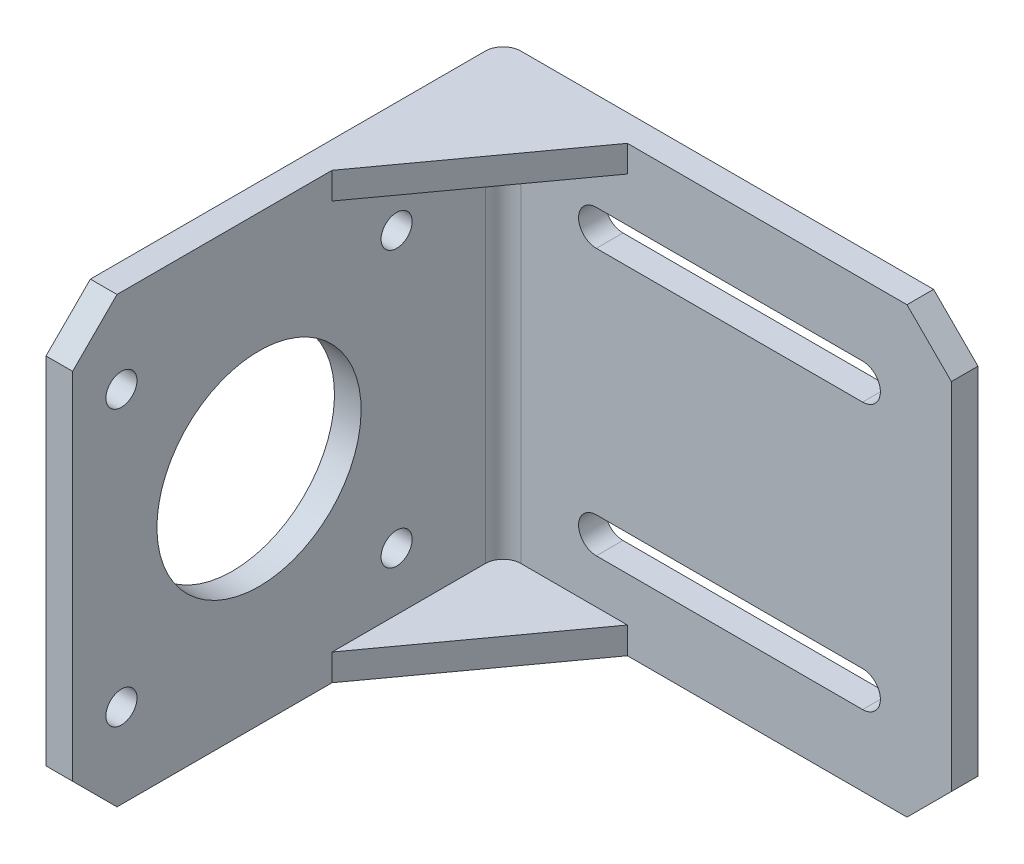
ISO-10303-21;
HEADER;
FILE_DESCRIPTION(('STEP AP214'),'2;1');
FILE_NAME('part.step','',(''),(''),'','','');
FILE_SCHEMA(('AUTOMOTIVE_DESIGN { 1 0 10303 214 1 1 1 1 }'));
ENDSEC;
DATA;
#1=APPLICATION_CONTEXT('core data for automotive mechanical design processes');
#2=APPLICATION_PROTOCOL_DEFINITION('international standard','automotive_design',2000,#1);
#3=PRODUCT_CONTEXT('',#1,'mechanical');
#4=PRODUCT('Part','Part','',(#3));
#5=PRODUCT_RELATED_PRODUCT_CATEGORY('part','',(#4));
#6=PRODUCT_DEFINITION_FORMATION('','',#4);
#7=PRODUCT_DEFINITION_CONTEXT('part definition',#1,'design');
#8=PRODUCT_DEFINITION('design','',#6,#7);
#9=PRODUCT_DEFINITION_SHAPE('','',#8);
#10=(LENGTH_UNIT() NAMED_UNIT(*) SI_UNIT(.MILLI.,.METRE.));
#11=(NAMED_UNIT(*) PLANE_ANGLE_UNIT() SI_UNIT($,.RADIAN.));
#12=(NAMED_UNIT(*) SI_UNIT($,.STERADIAN.) SOLID_ANGLE_UNIT());
#13=UNCERTAINTY_MEASURE_WITH_UNIT(LENGTH_MEASURE(1.E-05),#10,'distance_accuracy_value','');
#14=(GEOMETRIC_REPRESENTATION_CONTEXT(3) GLOBAL_UNCERTAINTY_ASSIGNED_CONTEXT((#13)) GLOBAL_UNIT_ASSIGNED_CONTEXT((#10,
#11,#12)) REPRESENTATION_CONTEXT('',''));
#15=CARTESIAN_POINT('',(0.,0.,0.));
#16=DIRECTION('',(0.,0.,1.));
#17=DIRECTION('',(1.,0.,0.));
#18=AXIS2_PLACEMENT_3D('',#15,#16,#17);
#19=CARTESIAN_POINT('',(-9.75000000000003,0.,3.));
#20=DIRECTION('',(0.809016994374951,0.,0.587785252292469));
#21=DIRECTION('',(0.,1.,0.));
#22=AXIS2_PLACEMENT_3D('',#19,#20,#21);
#23=PLANE('',#22);
#24=DIRECTION('',(0.,-1.,0.));
#25=VECTOR('',#24,1.);
#26=CARTESIAN_POINT('',(-9.75000000000003,-25.,3.));
#27=LINE('',#26,#25);
#28=CARTESIAN_POINT('',(-9.75000000000002,-22.,2.99999999999999));
#29=VERTEX_POINT('',#28);
#30=CARTESIAN_POINT('',(-9.75000000000001,-25.,3.));
#31=VERTEX_POINT('',#30);
#32=EDGE_CURVE('E329',#29,#31,#27,.T.);
#33=ORIENTED_EDGE('',*,*,#32,.F.);
#34=DIRECTION('',(0.587785252292469,0.,-0.809016994374951));
#35=VECTOR('',#34,1.);
#36=CARTESIAN_POINT('',(-9.75000000000003,-22.,3.));
#37=LINE('',#36,#35);
#38=CARTESIAN_POINT('',(-23.75,-22.,22.2693468865966));
#39=VERTEX_POINT('',#38);
#40=EDGE_CURVE('E345',#29,#39,#37,.F.);
#41=ORIENTED_EDGE('',*,*,#40,.T.);
#42=DIRECTION('',(0.,1.,0.));
#43=VECTOR('',#42,1.);
#44=CARTESIAN_POINT('',(-23.75,25.,22.2693468865966));
#45=LINE('',#44,#43);
#46=CARTESIAN_POINT('',(-23.75,-25.,22.2693468865966));
#47=VERTEX_POINT('',#46);
#48=EDGE_CURVE('E334',#47,#39,#45,.T.);
#49=ORIENTED_EDGE('',*,*,#48,.F.);
#50=DIRECTION('',(0.587785252292469,0.,-0.809016994374951));
#51=VECTOR('',#50,1.);
#52=CARTESIAN_POINT('',(-38.6864760679703,-25.,42.8276425021015));
#53=LINE('',#52,#51);
#54=EDGE_CURVE('E337',#31,#47,#53,.F.);
#55=ORIENTED_EDGE('',*,*,#54,.F.);
#56=EDGE_LOOP('',(#33,#41,#49,#55));
#57=FACE_BOUND('',#56,.T.);
#58=ADVANCED_FACE('F32',(#57),#23,.T.);
#59=CARTESIAN_POINT('',(26.75,25.,51.5));
#60=DIRECTION('',(-1.,0.,0.));
#61=DIRECTION('',(0.,-1.,0.));
#62=AXIS2_PLACEMENT_3D('',#59,#60,#61);
#63=PLANE('',#62);
#64=DIRECTION('',(0.,1.,0.));
#65=VECTOR('',#64,1.);
#66=CARTESIAN_POINT('',(26.75,25.,3.));
#67=LINE('',#66,#65);
#68=CARTESIAN_POINT('',(26.75,-20.,3.));
#69=VERTEX_POINT('',#68);
#70=CARTESIAN_POINT('',(26.75,20.,3.));
#71=VERTEX_POINT('',#70);
#72=EDGE_CURVE('E298',#69,#71,#67,.T.);
#73=ORIENTED_EDGE('',*,*,#72,.F.);
#74=DIRECTION('',(0.,0.,-1.));
#75=VECTOR('',#74,1.);
#76=CARTESIAN_POINT('',(26.75,-20.,51.5));
#77=LINE('',#76,#75);
#78=CARTESIAN_POINT('',(26.75,-20.,0.));
#79=VERTEX_POINT('',#78);
#80=EDGE_CURVE('E360',#69,#79,#77,.T.);
#81=ORIENTED_EDGE('',*,*,#80,.T.);
#82=DIRECTION('',(0.,1.,0.));
#83=VECTOR('',#82,1.);
#84=CARTESIAN_POINT('',(26.75,25.,0.));
#85=LINE('',#84,#83);
#86=CARTESIAN_POINT('',(26.75,20.,0.));
#87=VERTEX_POINT('',#86);
#88=EDGE_CURVE('E312',#79,#87,#85,.T.);
#89=ORIENTED_EDGE('',*,*,#88,.T.);
#90=DIRECTION('',(0.,0.,1.));
#91=VECTOR('',#90,1.);
#92=CARTESIAN_POINT('',(26.75,20.,51.5));
#93=LINE('',#92,#91);
#94=EDGE_CURVE('E348',#87,#71,#93,.T.);
#95=ORIENTED_EDGE('',*,*,#94,.T.);
#96=EDGE_LOOP('',(#73,#81,#89,#95));
#97=FACE_BOUND('',#96,.T.);
#98=ADVANCED_FACE('F440',(#97),#63,.F.);
#99=CARTESIAN_POINT('',(-26.75,25.,51.5));
#100=DIRECTION('',(0.,-1.,0.));
#101=DIRECTION('',(0.,0.,-1.));
#102=AXIS2_PLACEMENT_3D('',#99,#100,#101);
#103=PLANE('',#102);
#104=DIRECTION('',(-1.,0.,0.));
#105=VECTOR('',#104,1.);
#106=CARTESIAN_POINT('',(-26.75,25.,0.));
#107=LINE('',#106,#105);
#108=CARTESIAN_POINT('',(21.75,25.,0.));
#109=VERTEX_POINT('',#108);
#110=CARTESIAN_POINT('',(-24.75,25.,0.));
#111=VERTEX_POINT('',#110);
#112=EDGE_CURVE('E322',#109,#111,#107,.T.);
#113=ORIENTED_EDGE('',*,*,#112,.T.);
#114=CARTESIAN_POINT('',(-24.75,25.,2.));
#115=DIRECTION('',(0.,-1.,0.));
#116=DIRECTION('',(0.,0.,-1.));
#117=AXIS2_PLACEMENT_3D('',#114,#115,#116);
#118=CIRCLE('',#117,2.);
#119=CARTESIAN_POINT('',(-26.75,25.,2.));
#120=VERTEX_POINT('',#119);
#121=EDGE_CURVE('E11',#111,#120,#118,.F.);
#122=ORIENTED_EDGE('',*,*,#121,.T.);
#123=DIRECTION('',(0.,0.,-1.));
#124=VECTOR('',#123,1.);
#125=CARTESIAN_POINT('',(-26.75,25.,51.5));
#126=LINE('',#125,#124);
#127=CARTESIAN_POINT('',(-26.75,25.,46.5));
#128=VERTEX_POINT('',#127);
#129=EDGE_CURVE('E326',#128,#120,#126,.T.);
#130=ORIENTED_EDGE('',*,*,#129,.F.);
#131=DIRECTION('',(1.,0.,0.));
#132=VECTOR('',#131,1.);
#133=CARTESIAN_POINT('',(-23.75,25.,46.5));
#134=LINE('',#133,#132);
#135=CARTESIAN_POINT('',(-23.75,25.,46.5));
#136=VERTEX_POINT('',#135);
#137=EDGE_CURVE('E376',#128,#136,#134,.T.);
#138=ORIENTED_EDGE('',*,*,#137,.T.);
#139=DIRECTION('',(0.,0.,1.));
#140=VECTOR('',#139,1.);
#141=CARTESIAN_POINT('',(-23.75,25.,3.));
#142=LINE('',#141,#140);
#143=CARTESIAN_POINT('',(-23.75,25.,22.2693468865966));
#144=VERTEX_POINT('',#143);
#145=EDGE_CURVE('E306',#144,#136,#142,.T.);
#146=ORIENTED_EDGE('',*,*,#145,.F.);
#147=DIRECTION('',(-0.587785252292469,0.,0.809016994374951));
#148=VECTOR('',#147,1.);
#149=CARTESIAN_POINT('',(-38.6864760679703,25.,42.8276425021015));
#150=LINE('',#149,#148);
#151=CARTESIAN_POINT('',(-9.75000000000003,25.,3.));
#152=VERTEX_POINT('',#151);
#153=EDGE_CURVE('E339',#144,#152,#150,.F.);
#154=ORIENTED_EDGE('',*,*,#153,.T.);
#155=DIRECTION('',(-1.,0.,0.));
#156=VECTOR('',#155,1.);
#157=CARTESIAN_POINT('',(26.75,25.,3.));
#158=LINE('',#157,#156);
#159=CARTESIAN_POINT('',(21.75,25.,3.));
#160=VERTEX_POINT('',#159);
#161=EDGE_CURVE('E301',#160,#152,#158,.T.);
#162=ORIENTED_EDGE('',*,*,#161,.F.);
#163=DIRECTION('',(0.,0.,-1.));
#164=VECTOR('',#163,1.);
#165=CARTESIAN_POINT('',(21.75,25.,51.5));
#166=LINE('',#165,#164);
#167=EDGE_CURVE('E378',#160,#109,#166,.T.);
#168=ORIENTED_EDGE('',*,*,#167,.T.);
#169=EDGE_LOOP('',(#113,#122,#130,#138,#146,#154,#162,#168));
#170=FACE_BOUND('',#169,.T.);
#171=ADVANCED_FACE('F431',(#170),#103,.F.);
#172=CARTESIAN_POINT('',(-26.75,25.,51.5));
#173=DIRECTION('',(1.,0.,0.));
#174=DIRECTION('',(0.,1.,0.));
#175=AXIS2_PLACEMENT_3D('',#172,#173,#174);
#176=PLANE('',#175);
#177=CARTESIAN_POINT('',(-26.75,0.,30.5));
#178=DIRECTION('',(-1.,0.,0.));
#179=DIRECTION('',(0.,-1.,0.));
#180=AXIS2_PLACEMENT_3D('',#177,#178,#179);
#181=CIRCLE('',#180,11.5);
#182=CARTESIAN_POINT('',(-26.75,-11.5,30.5));
#183=VERTEX_POINT('',#182);
#184=EDGE_CURVE('E268',#183,#183,#181,.T.);
#185=ORIENTED_EDGE('',*,*,#184,.F.);
#186=EDGE_LOOP('',(#185));
#187=FACE_BOUND('',#186,.T.);
#188=CARTESIAN_POINT('',(-26.75,-15.5,15.));
#189=DIRECTION('',(-1.,0.,0.));
#190=DIRECTION('',(0.,-1.,0.));
#191=AXIS2_PLACEMENT_3D('',#188,#189,#190);
#192=CIRCLE('',#191,1.75);
#193=CARTESIAN_POINT('',(-26.75,-17.25,15.));
#194=VERTEX_POINT('',#193);
#195=EDGE_CURVE('E272',#194,#194,#192,.T.);
#196=ORIENTED_EDGE('',*,*,#195,.F.);
#197=EDGE_LOOP('',(#196));
#198=FACE_BOUND('',#197,.T.);
#199=CARTESIAN_POINT('',(-26.75,15.5,15.));
#200=DIRECTION('',(-1.,0.,0.));
#201=DIRECTION('',(0.,-1.,0.));
#202=AXIS2_PLACEMENT_3D('',#199,#200,#201);
#203=CIRCLE('',#202,1.75);
#204=CARTESIAN_POINT('',(-26.75,13.75,15.));
#205=VERTEX_POINT('',#204);
#206=EDGE_CURVE('E276',#205,#205,#203,.T.);
#207=ORIENTED_EDGE('',*,*,#206,.F.);
#208=EDGE_LOOP('',(#207));
#209=FACE_BOUND('',#208,.T.);
#210=CARTESIAN_POINT('',(-26.75,-15.5,46.));
#211=DIRECTION('',(-1.,0.,0.));
#212=DIRECTION('',(0.,-1.,0.));
#213=AXIS2_PLACEMENT_3D('',#210,#211,#212);
#214=CIRCLE('',#213,1.75);
#215=CARTESIAN_POINT('',(-26.75,-17.25,46.));
#216=VERTEX_POINT('',#215);
#217=EDGE_CURVE('E280',#216,#216,#214,.T.);
#218=ORIENTED_EDGE('',*,*,#217,.F.);
#219=EDGE_LOOP('',(#218));
#220=FACE_BOUND('',#219,.T.);
#221=CARTESIAN_POINT('',(-26.75,15.5,46.));
#222=DIRECTION('',(-1.,0.,0.));
#223=DIRECTION('',(0.,-1.,0.));
#224=AXIS2_PLACEMENT_3D('',#221,#222,#223);
#225=CIRCLE('',#224,1.75);
#226=CARTESIAN_POINT('',(-26.75,13.75,46.));
#227=VERTEX_POINT('',#226);
#228=EDGE_CURVE('E284',#227,#227,#225,.T.);
#229=ORIENTED_EDGE('',*,*,#228,.F.);
#230=EDGE_LOOP('',(#229));
#231=FACE_BOUND('',#230,.T.);
#232=ORIENTED_EDGE('',*,*,#129,.T.);
#233=DIRECTION('',(0.,-1.,0.));
#234=VECTOR('',#233,1.);
#235=CARTESIAN_POINT('',(-26.75,25.,2.));
#236=LINE('',#235,#234);
#237=CARTESIAN_POINT('',(-26.75,-25.,2.));
#238=VERTEX_POINT('',#237);
#239=EDGE_CURVE('E404',#120,#238,#236,.T.);
#240=ORIENTED_EDGE('',*,*,#239,.T.);
#241=DIRECTION('',(0.,0.,-1.));
#242=VECTOR('',#241,1.);
#243=CARTESIAN_POINT('',(-26.75,-25.,51.5));
#244=LINE('',#243,#242);
#245=CARTESIAN_POINT('',(-26.75,-25.,46.5));
#246=VERTEX_POINT('',#245);
#247=EDGE_CURVE('E318',#246,#238,#244,.T.);
#248=ORIENTED_EDGE('',*,*,#247,.F.);
#249=DIRECTION('',(0.,0.707106781186546,0.707106781186549));
#250=VECTOR('',#249,1.);
#251=CARTESIAN_POINT('',(-26.75,-20.,51.5));
#252=LINE('',#251,#250);
#253=CARTESIAN_POINT('',(-26.75,-20.,51.5));
#254=VERTEX_POINT('',#253);
#255=EDGE_CURVE('E387',#246,#254,#252,.T.);
#256=ORIENTED_EDGE('',*,*,#255,.T.);
#257=DIRECTION('',(0.,-1.,0.));
#258=VECTOR('',#257,1.);
#259=CARTESIAN_POINT('',(-26.75,25.,51.5));
#260=LINE('',#259,#258);
#261=CARTESIAN_POINT('',(-26.75,20.,51.5));
#262=VERTEX_POINT('',#261);
#263=EDGE_CURVE('E315',#262,#254,#260,.T.);
#264=ORIENTED_EDGE('',*,*,#263,.F.);
#265=DIRECTION('',(0.,0.707106781186546,-0.707106781186549));
#266=VECTOR('',#265,1.);
#267=CARTESIAN_POINT('',(-26.75,20.,51.5));
#268=LINE('',#267,#266);
#269=EDGE_CURVE('E389',#262,#128,#268,.T.);
#270=ORIENTED_EDGE('',*,*,#269,.T.);
#271=EDGE_LOOP('',(#232,#240,#248,#256,#264,#270));
#272=FACE_BOUND('',#271,.T.);
#273=ADVANCED_FACE('F410',(#187,#198,#209,#220,#231,#272),#176,.F.);
#274=CARTESIAN_POINT('',(-26.75,-25.,51.5));
#275=DIRECTION('',(0.,1.,0.));
#276=DIRECTION('',(0.,0.,1.));
#277=AXIS2_PLACEMENT_3D('',#274,#275,#276);
#278=PLANE('',#277);
#279=ORIENTED_EDGE('',*,*,#247,.T.);
#280=CARTESIAN_POINT('',(-24.75,-25.,2.));
#281=DIRECTION('',(0.,1.,0.));
#282=DIRECTION('',(0.,0.,1.));
#283=AXIS2_PLACEMENT_3D('',#280,#281,#282);
#284=CIRCLE('',#283,2.);
#285=CARTESIAN_POINT('',(-24.75,-25.,0.));
#286=VERTEX_POINT('',#285);
#287=EDGE_CURVE('E54',#238,#286,#284,.F.);
#288=ORIENTED_EDGE('',*,*,#287,.T.);
#289=DIRECTION('',(1.,0.,0.));
#290=VECTOR('',#289,1.);
#291=CARTESIAN_POINT('',(-26.75,-25.,0.));
#292=LINE('',#291,#290);
#293=CARTESIAN_POINT('',(21.7499999999999,-25.,0.));
#294=VERTEX_POINT('',#293);
#295=EDGE_CURVE('E319',#286,#294,#292,.T.);
#296=ORIENTED_EDGE('',*,*,#295,.T.);
#297=DIRECTION('',(0.,0.,1.));
#298=VECTOR('',#297,1.);
#299=CARTESIAN_POINT('',(21.7499999999999,-25.,51.5));
#300=LINE('',#299,#298);
#301=CARTESIAN_POINT('',(21.7499999999999,-25.,3.));
#302=VERTEX_POINT('',#301);
#303=EDGE_CURVE('E370',#294,#302,#300,.T.);
#304=ORIENTED_EDGE('',*,*,#303,.T.);
#305=DIRECTION('',(1.,0.,0.));
#306=VECTOR('',#305,1.);
#307=CARTESIAN_POINT('',(26.75,-25.,3.));
#308=LINE('',#307,#306);
#309=EDGE_CURVE('E303',#31,#302,#308,.T.);
#310=ORIENTED_EDGE('',*,*,#309,.F.);
#311=ORIENTED_EDGE('',*,*,#54,.T.);
#312=DIRECTION('',(0.,0.,1.));
#313=VECTOR('',#312,1.);
#314=CARTESIAN_POINT('',(-23.75,-25.,3.));
#315=LINE('',#314,#313);
#316=CARTESIAN_POINT('',(-23.75,-25.,46.4999999999999));
#317=VERTEX_POINT('',#316);
#318=EDGE_CURVE('E309',#47,#317,#315,.T.);
#319=ORIENTED_EDGE('',*,*,#318,.T.);
#320=DIRECTION('',(-1.,0.,0.));
#321=VECTOR('',#320,1.);
#322=CARTESIAN_POINT('',(-26.75,-25.,46.5));
#323=LINE('',#322,#321);
#324=EDGE_CURVE('E368',#317,#246,#323,.T.);
#325=ORIENTED_EDGE('',*,*,#324,.T.);
#326=EDGE_LOOP('',(#279,#288,#296,#304,#310,#311,#319,#325));
#327=FACE_BOUND('',#326,.T.);
#328=ADVANCED_FACE('F415',(#327),#278,.F.);
#329=CARTESIAN_POINT('',(0.,0.,51.5));
#330=DIRECTION('',(0.,0.,1.));
#331=DIRECTION('',(1.,0.,0.));
#332=AXIS2_PLACEMENT_3D('',#329,#330,#331);
#333=PLANE('',#332);
#334=DIRECTION('',(0.,-1.,0.));
#335=VECTOR('',#334,1.);
#336=CARTESIAN_POINT('',(-23.75,25.,51.5));
#337=LINE('',#336,#335);
#338=CARTESIAN_POINT('',(-23.75,20.,51.5));
#339=VERTEX_POINT('',#338);
#340=CARTESIAN_POINT('',(-23.75,-20.,51.5));
#341=VERTEX_POINT('',#340);
#342=EDGE_CURVE('E296',#339,#341,#337,.T.);
#343=ORIENTED_EDGE('',*,*,#342,.F.);
#344=DIRECTION('',(-1.,0.,0.));
#345=VECTOR('',#344,1.);
#346=CARTESIAN_POINT('',(-26.75,20.,51.5));
#347=LINE('',#346,#345);
#348=EDGE_CURVE('E384',#339,#262,#347,.T.);
#349=ORIENTED_EDGE('',*,*,#348,.T.);
#350=ORIENTED_EDGE('',*,*,#263,.T.);
#351=DIRECTION('',(1.,0.,0.));
#352=VECTOR('',#351,1.);
#353=CARTESIAN_POINT('',(-23.75,-20.,51.5));
#354=LINE('',#353,#352);
#355=EDGE_CURVE('E381',#254,#341,#354,.T.);
#356=ORIENTED_EDGE('',*,*,#355,.T.);
#357=EDGE_LOOP('',(#343,#349,#350,#356));
#358=FACE_BOUND('',#357,.T.);
#359=ADVANCED_FACE('F424',(#358),#333,.T.);
#360=CARTESIAN_POINT('',(0.,0.,0.));
#361=DIRECTION('',(0.,0.,1.));
#362=DIRECTION('',(1.,0.,0.));
#363=AXIS2_PLACEMENT_3D('',#360,#361,#362);
#364=PLANE('',#363);
#365=DIRECTION('',(-1.,0.,0.));
#366=VECTOR('',#365,1.);
#367=CARTESIAN_POINT('',(0.,-13.,0.));
#368=LINE('',#367,#366);
#369=CARTESIAN_POINT('',(16.75,-13.,0.));
#370=VERTEX_POINT('',#369);
#371=CARTESIAN_POINT('',(-13.25,-13.,0.));
#372=VERTEX_POINT('',#371);
#373=EDGE_CURVE('E230',#370,#372,#368,.T.);
#374=ORIENTED_EDGE('',*,*,#373,.T.);
#375=CARTESIAN_POINT('',(-13.25,-15.,0.));
#376=DIRECTION('',(0.,0.,1.));
#377=DIRECTION('',(1.,0.,0.));
#378=AXIS2_PLACEMENT_3D('',#375,#376,#377);
#379=CIRCLE('',#378,2.);
#380=CARTESIAN_POINT('',(-13.25,-17.,0.));
#381=VERTEX_POINT('',#380);
#382=EDGE_CURVE('E233',#372,#381,#379,.T.);
#383=ORIENTED_EDGE('',*,*,#382,.T.);
#384=DIRECTION('',(1.,0.,0.));
#385=VECTOR('',#384,1.);
#386=CARTESIAN_POINT('',(0.,-17.,0.));
#387=LINE('',#386,#385);
#388=CARTESIAN_POINT('',(16.75,-17.,0.));
#389=VERTEX_POINT('',#388);
#390=EDGE_CURVE('E225',#381,#389,#387,.T.);
#391=ORIENTED_EDGE('',*,*,#390,.T.);
#392=CARTESIAN_POINT('',(16.75,-15.,0.));
#393=DIRECTION('',(0.,0.,1.));
#394=DIRECTION('',(1.,0.,0.));
#395=AXIS2_PLACEMENT_3D('',#392,#393,#394);
#396=CIRCLE('',#395,2.);
#397=EDGE_CURVE('E200',#389,#370,#396,.T.);
#398=ORIENTED_EDGE('',*,*,#397,.T.);
#399=EDGE_LOOP('',(#374,#383,#391,#398));
#400=FACE_BOUND('',#399,.T.);
#401=DIRECTION('',(-1.,0.,0.));
#402=VECTOR('',#401,1.);
#403=CARTESIAN_POINT('',(0.,17.,0.));
#404=LINE('',#403,#402);
#405=CARTESIAN_POINT('',(16.75,17.,0.));
#406=VERTEX_POINT('',#405);
#407=CARTESIAN_POINT('',(-13.25,17.,0.));
#408=VERTEX_POINT('',#407);
#409=EDGE_CURVE('E262',#406,#408,#404,.T.);
#410=ORIENTED_EDGE('',*,*,#409,.T.);
#411=CARTESIAN_POINT('',(-13.25,15.,0.));
#412=DIRECTION('',(0.,0.,1.));
#413=DIRECTION('',(1.,0.,0.));
#414=AXIS2_PLACEMENT_3D('',#411,#412,#413);
#415=CIRCLE('',#414,2.);
#416=CARTESIAN_POINT('',(-13.25,13.,0.));
#417=VERTEX_POINT('',#416);
#418=EDGE_CURVE('E265',#408,#417,#415,.T.);
#419=ORIENTED_EDGE('',*,*,#418,.T.);
#420=DIRECTION('',(1.,0.,0.));
#421=VECTOR('',#420,1.);
#422=CARTESIAN_POINT('',(0.,13.,0.));
#423=LINE('',#422,#421);
#424=CARTESIAN_POINT('',(16.75,13.,0.));
#425=VERTEX_POINT('',#424);
#426=EDGE_CURVE('E250',#417,#425,#423,.T.);
#427=ORIENTED_EDGE('',*,*,#426,.T.);
#428=CARTESIAN_POINT('',(16.75,15.,0.));
#429=DIRECTION('',(0.,0.,1.));
#430=DIRECTION('',(1.,0.,0.));
#431=AXIS2_PLACEMENT_3D('',#428,#429,#430);
#432=CIRCLE('',#431,2.);
#433=EDGE_CURVE('E259',#425,#406,#432,.T.);
#434=ORIENTED_EDGE('',*,*,#433,.T.);
#435=EDGE_LOOP('',(#410,#419,#427,#434));
#436=FACE_BOUND('',#435,.T.);
#437=ORIENTED_EDGE('',*,*,#295,.F.);
#438=DIRECTION('',(0.,-1.,0.));
#439=VECTOR('',#438,1.);
#440=CARTESIAN_POINT('',(-24.75,0.,0.));
#441=LINE('',#440,#439);
#442=EDGE_CURVE('E40',#286,#111,#441,.F.);
#443=ORIENTED_EDGE('',*,*,#442,.T.);
#444=ORIENTED_EDGE('',*,*,#112,.F.);
#445=DIRECTION('',(-0.707106781186546,0.707106781186549,0.));
#446=VECTOR('',#445,1.);
#447=CARTESIAN_POINT('',(21.75,25.,0.));
#448=LINE('',#447,#446);
#449=EDGE_CURVE('E363',#109,#87,#448,.F.);
#450=ORIENTED_EDGE('',*,*,#449,.T.);
#451=ORIENTED_EDGE('',*,*,#88,.F.);
#452=DIRECTION('',(0.707106781186549,0.707106781186546,0.));
#453=VECTOR('',#452,1.);
#454=CARTESIAN_POINT('',(26.75,-20.,0.));
#455=LINE('',#454,#453);
#456=EDGE_CURVE('E365',#79,#294,#455,.F.);
#457=ORIENTED_EDGE('',*,*,#456,.T.);
#458=EDGE_LOOP('',(#437,#443,#444,#450,#451,#457));
#459=FACE_BOUND('',#458,.T.);
#460=ADVANCED_FACE('F479',(#400,#436,#459),#364,.F.);
#461=CARTESIAN_POINT('',(-23.75,25.,3.));
#462=DIRECTION('',(-1.,0.,0.));
#463=DIRECTION('',(0.,-1.,0.));
#464=AXIS2_PLACEMENT_3D('',#461,#462,#463);
#465=PLANE('',#464);
#466=CARTESIAN_POINT('',(-23.75,0.,30.5));
#467=DIRECTION('',(-1.,0.,0.));
#468=DIRECTION('',(0.,-1.,0.));
#469=AXIS2_PLACEMENT_3D('',#466,#467,#468);
#470=CIRCLE('',#469,11.5);
#471=CARTESIAN_POINT('',(-23.75,-11.5,30.5));
#472=VERTEX_POINT('',#471);
#473=EDGE_CURVE('E271',#472,#472,#470,.T.);
#474=ORIENTED_EDGE('',*,*,#473,.T.);
#475=EDGE_LOOP('',(#474));
#476=FACE_BOUND('',#475,.T.);
#477=CARTESIAN_POINT('',(-23.75,-15.5,15.));
#478=DIRECTION('',(-1.,0.,0.));
#479=DIRECTION('',(0.,-1.,0.));
#480=AXIS2_PLACEMENT_3D('',#477,#478,#479);
#481=CIRCLE('',#480,1.75);
#482=CARTESIAN_POINT('',(-23.75,-17.25,15.));
#483=VERTEX_POINT('',#482);
#484=EDGE_CURVE('E275',#483,#483,#481,.T.);
#485=ORIENTED_EDGE('',*,*,#484,.T.);
#486=EDGE_LOOP('',(#485));
#487=FACE_BOUND('',#486,.T.);
#488=CARTESIAN_POINT('',(-23.75,15.5,15.));
#489=DIRECTION('',(-1.,0.,0.));
#490=DIRECTION('',(0.,-1.,0.));
#491=AXIS2_PLACEMENT_3D('',#488,#489,#490);
#492=CIRCLE('',#491,1.75);
#493=CARTESIAN_POINT('',(-23.75,13.75,15.));
#494=VERTEX_POINT('',#493);
#495=EDGE_CURVE('E279',#494,#494,#492,.T.);
#496=ORIENTED_EDGE('',*,*,#495,.T.);
#497=EDGE_LOOP('',(#496));
#498=FACE_BOUND('',#497,.T.);
#499=CARTESIAN_POINT('',(-23.75,-15.5,46.));
#500=DIRECTION('',(-1.,0.,0.));
#501=DIRECTION('',(0.,-1.,0.));
#502=AXIS2_PLACEMENT_3D('',#499,#500,#501);
#503=CIRCLE('',#502,1.75);
#504=CARTESIAN_POINT('',(-23.75,-17.25,46.));
#505=VERTEX_POINT('',#504);
#506=EDGE_CURVE('E283',#505,#505,#503,.T.);
#507=ORIENTED_EDGE('',*,*,#506,.T.);
#508=EDGE_LOOP('',(#507));
#509=FACE_BOUND('',#508,.T.);
#510=CARTESIAN_POINT('',(-23.75,15.5,46.));
#511=DIRECTION('',(-1.,0.,0.));
#512=DIRECTION('',(0.,-1.,0.));
#513=AXIS2_PLACEMENT_3D('',#510,#511,#512);
#514=CIRCLE('',#513,1.75);
#515=CARTESIAN_POINT('',(-23.75,13.75,46.));
#516=VERTEX_POINT('',#515);
#517=EDGE_CURVE('E287',#516,#516,#514,.T.);
#518=ORIENTED_EDGE('',*,*,#517,.T.);
#519=EDGE_LOOP('',(#518));
#520=FACE_BOUND('',#519,.T.);
#521=DIRECTION('',(0.,0.,-1.));
#522=VECTOR('',#521,1.);
#523=CARTESIAN_POINT('',(-23.75,-22.,2.99999999999999));
#524=LINE('',#523,#522);
#525=CARTESIAN_POINT('',(-23.75,-22.,5.));
#526=VERTEX_POINT('',#525);
#527=EDGE_CURVE('E290',#39,#526,#524,.T.);
#528=ORIENTED_EDGE('',*,*,#527,.T.);
#529=DIRECTION('',(0.,1.,0.));
#530=VECTOR('',#529,1.);
#531=CARTESIAN_POINT('',(-23.75,22.,5.));
#532=LINE('',#531,#530);
#533=CARTESIAN_POINT('',(-23.75,22.,4.99999999999999));
#534=VERTEX_POINT('',#533);
#535=EDGE_CURVE('E395',#526,#534,#532,.T.);
#536=ORIENTED_EDGE('',*,*,#535,.T.);
#537=DIRECTION('',(0.,0.,1.));
#538=VECTOR('',#537,1.);
#539=CARTESIAN_POINT('',(-23.75,22.,3.));
#540=LINE('',#539,#538);
#541=CARTESIAN_POINT('',(-23.75,22.,22.2693468865966));
#542=VERTEX_POINT('',#541);
#543=EDGE_CURVE('E288',#534,#542,#540,.T.);
#544=ORIENTED_EDGE('',*,*,#543,.T.);
#545=EDGE_CURVE('E333',#542,#144,#45,.T.);
#546=ORIENTED_EDGE('',*,*,#545,.T.);
#547=ORIENTED_EDGE('',*,*,#145,.T.);
#548=DIRECTION('',(0.,-0.707106781186546,0.707106781186549));
#549=VECTOR('',#548,1.);
#550=CARTESIAN_POINT('',(-23.75,20.,51.5));
#551=LINE('',#550,#549);
#552=EDGE_CURVE('E393',#136,#339,#551,.T.);
#553=ORIENTED_EDGE('',*,*,#552,.T.);
#554=ORIENTED_EDGE('',*,*,#342,.T.);
#555=DIRECTION('',(0.,-0.707106781186546,-0.707106781186549));
#556=VECTOR('',#555,1.);
#557=CARTESIAN_POINT('',(-23.75,-20.,51.5));
#558=LINE('',#557,#556);
#559=EDGE_CURVE('E391',#341,#317,#558,.T.);
#560=ORIENTED_EDGE('',*,*,#559,.T.);
#561=ORIENTED_EDGE('',*,*,#318,.F.);
#562=ORIENTED_EDGE('',*,*,#48,.T.);
#563=EDGE_LOOP('',(#528,#536,#544,#546,#547,#553,#554,#560,#561,#562));
#564=FACE_BOUND('',#563,.T.);
#565=ADVANCED_FACE('F461',(#476,#487,#498,#509,#520,#564),#465,.F.);
#566=CARTESIAN_POINT('',(0.,0.,3.));
#567=DIRECTION('',(0.,0.,-1.));
#568=DIRECTION('',(-1.,0.,0.));
#569=AXIS2_PLACEMENT_3D('',#566,#567,#568);
#570=PLANE('',#569);
#571=DIRECTION('',(1.,0.,0.));
#572=VECTOR('',#571,1.);
#573=CARTESIAN_POINT('',(-13.25,-17.,3.));
#574=LINE('',#573,#572);
#575=CARTESIAN_POINT('',(-13.25,-17.,3.));
#576=VERTEX_POINT('',#575);
#577=CARTESIAN_POINT('',(16.75,-17.,3.));
#578=VERTEX_POINT('',#577);
#579=EDGE_CURVE('E208',#576,#578,#574,.T.);
#580=ORIENTED_EDGE('',*,*,#579,.F.);
#581=CARTESIAN_POINT('',(-13.25,-15.,3.));
#582=DIRECTION('',(0.,0.,1.));
#583=DIRECTION('',(1.,0.,0.));
#584=AXIS2_PLACEMENT_3D('',#581,#582,#583);
#585=CIRCLE('',#584,2.);
#586=CARTESIAN_POINT('',(-13.25,-13.,3.));
#587=VERTEX_POINT('',#586);
#588=EDGE_CURVE('E213',#587,#576,#585,.T.);
#589=ORIENTED_EDGE('',*,*,#588,.F.);
#590=DIRECTION('',(-1.,0.,0.));
#591=VECTOR('',#590,1.);
#592=CARTESIAN_POINT('',(-13.25,-13.,3.));
#593=LINE('',#592,#591);
#594=CARTESIAN_POINT('',(16.75,-13.,3.));
#595=VERTEX_POINT('',#594);
#596=EDGE_CURVE('E218',#595,#587,#593,.T.);
#597=ORIENTED_EDGE('',*,*,#596,.F.);
#598=CARTESIAN_POINT('',(16.75,-15.,3.));
#599=DIRECTION('',(0.,0.,1.));
#600=DIRECTION('',(1.,0.,0.));
#601=AXIS2_PLACEMENT_3D('',#598,#599,#600);
#602=CIRCLE('',#601,2.);
#603=EDGE_CURVE('E197',#578,#595,#602,.T.);
#604=ORIENTED_EDGE('',*,*,#603,.F.);
#605=EDGE_LOOP('',(#580,#589,#597,#604));
#606=FACE_BOUND('',#605,.T.);
#607=DIRECTION('',(1.,0.,0.));
#608=VECTOR('',#607,1.);
#609=CARTESIAN_POINT('',(-13.25,13.,3.));
#610=LINE('',#609,#608);
#611=CARTESIAN_POINT('',(-13.25,13.,3.));
#612=VERTEX_POINT('',#611);
#613=CARTESIAN_POINT('',(16.75,13.,3.));
#614=VERTEX_POINT('',#613);
#615=EDGE_CURVE('E238',#612,#614,#610,.T.);
#616=ORIENTED_EDGE('',*,*,#615,.F.);
#617=CARTESIAN_POINT('',(-13.25,15.,3.));
#618=DIRECTION('',(0.,0.,1.));
#619=DIRECTION('',(1.,0.,0.));
#620=AXIS2_PLACEMENT_3D('',#617,#618,#619);
#621=CIRCLE('',#620,2.);
#622=CARTESIAN_POINT('',(-13.25,17.,3.));
#623=VERTEX_POINT('',#622);
#624=EDGE_CURVE('E236',#623,#612,#621,.T.);
#625=ORIENTED_EDGE('',*,*,#624,.F.);
#626=DIRECTION('',(-1.,0.,0.));
#627=VECTOR('',#626,1.);
#628=CARTESIAN_POINT('',(-13.25,17.,3.));
#629=LINE('',#628,#627);
#630=CARTESIAN_POINT('',(16.75,17.,3.));
#631=VERTEX_POINT('',#630);
#632=EDGE_CURVE('E244',#631,#623,#629,.T.);
#633=ORIENTED_EDGE('',*,*,#632,.F.);
#634=CARTESIAN_POINT('',(16.75,15.,3.));
#635=DIRECTION('',(0.,0.,1.));
#636=DIRECTION('',(1.,0.,0.));
#637=AXIS2_PLACEMENT_3D('',#634,#635,#636);
#638=CIRCLE('',#637,2.);
#639=EDGE_CURVE('E241',#614,#631,#638,.T.);
#640=ORIENTED_EDGE('',*,*,#639,.F.);
#641=EDGE_LOOP('',(#616,#625,#633,#640));
#642=FACE_BOUND('',#641,.T.);
#643=DIRECTION('',(1.,0.,0.));
#644=VECTOR('',#643,1.);
#645=CARTESIAN_POINT('',(-23.75,22.,3.));
#646=LINE('',#645,#644);
#647=CARTESIAN_POINT('',(-21.75,22.,3.));
#648=VERTEX_POINT('',#647);
#649=CARTESIAN_POINT('',(-9.75000000000004,22.,3.));
#650=VERTEX_POINT('',#649);
#651=EDGE_CURVE('E293',#648,#650,#646,.T.);
#652=ORIENTED_EDGE('',*,*,#651,.F.);
#653=DIRECTION('',(0.,1.,0.));
#654=VECTOR('',#653,1.);
#655=CARTESIAN_POINT('',(-21.75,-22.,3.));
#656=LINE('',#655,#654);
#657=CARTESIAN_POINT('',(-21.75,-22.,2.99999999999999));
#658=VERTEX_POINT('',#657);
#659=EDGE_CURVE('E400',#648,#658,#656,.F.);
#660=ORIENTED_EDGE('',*,*,#659,.T.);
#661=DIRECTION('',(1.,0.,0.));
#662=VECTOR('',#661,1.);
#663=CARTESIAN_POINT('',(-23.75,-22.,2.99999999999999));
#664=LINE('',#663,#662);
#665=EDGE_CURVE('E294',#658,#29,#664,.T.);
#666=ORIENTED_EDGE('',*,*,#665,.T.);
#667=ORIENTED_EDGE('',*,*,#32,.T.);
#668=ORIENTED_EDGE('',*,*,#309,.T.);
#669=DIRECTION('',(-0.707106781186549,-0.707106781186546,0.));
#670=VECTOR('',#669,1.);
#671=CARTESIAN_POINT('',(26.75,-20.,3.));
#672=LINE('',#671,#670);
#673=EDGE_CURVE('E374',#302,#69,#672,.F.);
#674=ORIENTED_EDGE('',*,*,#673,.T.);
#675=ORIENTED_EDGE('',*,*,#72,.T.);
#676=DIRECTION('',(0.707106781186546,-0.707106781186549,0.));
#677=VECTOR('',#676,1.);
#678=CARTESIAN_POINT('',(21.75,25.,3.));
#679=LINE('',#678,#677);
#680=EDGE_CURVE('E372',#71,#160,#679,.F.);
#681=ORIENTED_EDGE('',*,*,#680,.T.);
#682=ORIENTED_EDGE('',*,*,#161,.T.);
#683=EDGE_CURVE('E330',#152,#650,#27,.T.);
#684=ORIENTED_EDGE('',*,*,#683,.T.);
#685=EDGE_LOOP('',(#652,#660,#666,#667,#668,#674,#675,#681,#682,#684));
#686=FACE_BOUND('',#685,.T.);
#687=ADVANCED_FACE('F215',(#606,#642,#686),#570,.F.);
#688=ORIENTED_EDGE('',*,*,#545,.F.);
#689=DIRECTION('',(-0.587785252292469,0.,0.809016994374951));
#690=VECTOR('',#689,1.);
#691=CARTESIAN_POINT('',(-9.75000000000003,22.,3.));
#692=LINE('',#691,#690);
#693=EDGE_CURVE('E342',#542,#650,#692,.F.);
#694=ORIENTED_EDGE('',*,*,#693,.T.);
#695=ORIENTED_EDGE('',*,*,#683,.F.);
#696=ORIENTED_EDGE('',*,*,#153,.F.);
#697=EDGE_LOOP('',(#688,#694,#695,#696));
#698=FACE_BOUND('',#697,.T.);
#699=ADVANCED_FACE('F443',(#698),#23,.T.);
#700=CARTESIAN_POINT('',(-23.75,-22.,2.99999999999999));
#701=DIRECTION('',(0.,-1.,0.));
#702=DIRECTION('',(0.,0.,-1.));
#703=AXIS2_PLACEMENT_3D('',#700,#701,#702);
#704=PLANE('',#703);
#705=ORIENTED_EDGE('',*,*,#665,.F.);
#706=CARTESIAN_POINT('',(-21.75,-22.,5.));
#707=DIRECTION('',(0.,-1.,0.));
#708=DIRECTION('',(0.,0.,-1.));
#709=AXIS2_PLACEMENT_3D('',#706,#707,#708);
#710=CIRCLE('',#709,2.);
#711=EDGE_CURVE('E402',#658,#526,#710,.F.);
#712=ORIENTED_EDGE('',*,*,#711,.T.);
#713=ORIENTED_EDGE('',*,*,#527,.F.);
#714=ORIENTED_EDGE('',*,*,#40,.F.);
#715=EDGE_LOOP('',(#705,#712,#713,#714));
#716=FACE_BOUND('',#715,.T.);
#717=ADVANCED_FACE('F452',(#716),#704,.F.);
#718=CARTESIAN_POINT('',(-23.75,22.,3.));
#719=DIRECTION('',(0.,1.,0.));
#720=DIRECTION('',(0.,0.,1.));
#721=AXIS2_PLACEMENT_3D('',#718,#719,#720);
#722=PLANE('',#721);
#723=ORIENTED_EDGE('',*,*,#543,.F.);
#724=CARTESIAN_POINT('',(-21.75,22.,5.));
#725=DIRECTION('',(0.,1.,0.));
#726=DIRECTION('',(0.,0.,1.));
#727=AXIS2_PLACEMENT_3D('',#724,#725,#726);
#728=CIRCLE('',#727,2.);
#729=EDGE_CURVE('E398',#534,#648,#728,.F.);
#730=ORIENTED_EDGE('',*,*,#729,.T.);
#731=ORIENTED_EDGE('',*,*,#651,.T.);
#732=ORIENTED_EDGE('',*,*,#693,.F.);
#733=EDGE_LOOP('',(#723,#730,#731,#732));
#734=FACE_BOUND('',#733,.T.);
#735=ADVANCED_FACE('F458',(#734),#722,.F.);
#736=CARTESIAN_POINT('',(-16.75,15.5,46.));
#737=DIRECTION('',(-1.,0.,0.));
#738=DIRECTION('',(0.,-1.,0.));
#739=AXIS2_PLACEMENT_3D('',#736,#737,#738);
#740=CYLINDRICAL_SURFACE('',#739,1.75);
#741=ORIENTED_EDGE('',*,*,#228,.T.);
#742=EDGE_LOOP('',(#741));
#743=FACE_BOUND('',#742,.T.);
#744=ORIENTED_EDGE('',*,*,#517,.F.);
#745=EDGE_LOOP('',(#744));
#746=FACE_BOUND('',#745,.T.);
#747=ADVANCED_FACE('F495',(#743,#746),#740,.F.);
#748=CARTESIAN_POINT('',(-16.75,-15.5,46.));
#749=DIRECTION('',(-1.,0.,0.));
#750=DIRECTION('',(0.,-1.,0.));
#751=AXIS2_PLACEMENT_3D('',#748,#749,#750);
#752=CYLINDRICAL_SURFACE('',#751,1.75);
#753=ORIENTED_EDGE('',*,*,#217,.T.);
#754=EDGE_LOOP('',(#753));
#755=FACE_BOUND('',#754,.T.);
#756=ORIENTED_EDGE('',*,*,#506,.F.);
#757=EDGE_LOOP('',(#756));
#758=FACE_BOUND('',#757,.T.);
#759=ADVANCED_FACE('F500',(#755,#758),#752,.F.);
#760=CARTESIAN_POINT('',(-16.75,15.5,15.));
#761=DIRECTION('',(-1.,0.,0.));
#762=DIRECTION('',(0.,-1.,0.));
#763=AXIS2_PLACEMENT_3D('',#760,#761,#762);
#764=CYLINDRICAL_SURFACE('',#763,1.75);
#765=ORIENTED_EDGE('',*,*,#206,.T.);
#766=EDGE_LOOP('',(#765));
#767=FACE_BOUND('',#766,.T.);
#768=ORIENTED_EDGE('',*,*,#495,.F.);
#769=EDGE_LOOP('',(#768));
#770=FACE_BOUND('',#769,.T.);
#771=ADVANCED_FACE('F668',(#767,#770),#764,.F.);
#772=CARTESIAN_POINT('',(-16.75,-15.5,15.));
#773=DIRECTION('',(-1.,0.,0.));
#774=DIRECTION('',(0.,-1.,0.));
#775=AXIS2_PLACEMENT_3D('',#772,#773,#774);
#776=CYLINDRICAL_SURFACE('',#775,1.75);
#777=ORIENTED_EDGE('',*,*,#195,.T.);
#778=EDGE_LOOP('',(#777));
#779=FACE_BOUND('',#778,.T.);
#780=ORIENTED_EDGE('',*,*,#484,.F.);
#781=EDGE_LOOP('',(#780));
#782=FACE_BOUND('',#781,.T.);
#783=ADVANCED_FACE('F660',(#779,#782),#776,.F.);
#784=CARTESIAN_POINT('',(-16.75,0.,30.5));
#785=DIRECTION('',(-1.,0.,0.));
#786=DIRECTION('',(0.,-1.,0.));
#787=AXIS2_PLACEMENT_3D('',#784,#785,#786);
#788=CYLINDRICAL_SURFACE('',#787,11.5);
#789=ORIENTED_EDGE('',*,*,#184,.T.);
#790=EDGE_LOOP('',(#789));
#791=FACE_BOUND('',#790,.T.);
#792=ORIENTED_EDGE('',*,*,#473,.F.);
#793=EDGE_LOOP('',(#792));
#794=FACE_BOUND('',#793,.T.);
#795=ADVANCED_FACE('F652',(#791,#794),#788,.F.);
#796=CARTESIAN_POINT('',(-13.25,15.,-7.));
#797=DIRECTION('',(0.,0.,1.));
#798=DIRECTION('',(1.,0.,0.));
#799=AXIS2_PLACEMENT_3D('',#796,#797,#798);
#800=CYLINDRICAL_SURFACE('',#799,2.);
#801=DIRECTION('',(0.,0.,1.));
#802=VECTOR('',#801,1.);
#803=CARTESIAN_POINT('',(-13.25,17.,-7.));
#804=LINE('',#803,#802);
#805=EDGE_CURVE('E248',#408,#623,#804,.T.);
#806=ORIENTED_EDGE('',*,*,#805,.T.);
#807=ORIENTED_EDGE('',*,*,#624,.T.);
#808=DIRECTION('',(0.,0.,1.));
#809=VECTOR('',#808,1.);
#810=CARTESIAN_POINT('',(-13.25,13.,-7.));
#811=LINE('',#810,#809);
#812=EDGE_CURVE('E247',#417,#612,#811,.T.);
#813=ORIENTED_EDGE('',*,*,#812,.F.);
#814=ORIENTED_EDGE('',*,*,#418,.F.);
#815=EDGE_LOOP('',(#806,#807,#813,#814));
#816=FACE_BOUND('',#815,.T.);
#817=ADVANCED_FACE('F644',(#816),#800,.F.);
#818=CARTESIAN_POINT('',(-13.25,17.,-7.));
#819=DIRECTION('',(0.,1.,0.));
#820=DIRECTION('',(0.,0.,1.));
#821=AXIS2_PLACEMENT_3D('',#818,#819,#820);
#822=PLANE('',#821);
#823=DIRECTION('',(0.,0.,1.));
#824=VECTOR('',#823,1.);
#825=CARTESIAN_POINT('',(16.75,17.,-7.));
#826=LINE('',#825,#824);
#827=EDGE_CURVE('E251',#406,#631,#826,.T.);
#828=ORIENTED_EDGE('',*,*,#827,.T.);
#829=ORIENTED_EDGE('',*,*,#632,.T.);
#830=ORIENTED_EDGE('',*,*,#805,.F.);
#831=ORIENTED_EDGE('',*,*,#409,.F.);
#832=EDGE_LOOP('',(#828,#829,#830,#831));
#833=FACE_BOUND('',#832,.T.);
#834=ADVANCED_FACE('F636',(#833),#822,.F.);
#835=CARTESIAN_POINT('',(16.75,15.,-7.));
#836=DIRECTION('',(0.,0.,1.));
#837=DIRECTION('',(1.,0.,0.));
#838=AXIS2_PLACEMENT_3D('',#835,#836,#837);
#839=CYLINDRICAL_SURFACE('',#838,2.);
#840=DIRECTION('',(0.,0.,1.));
#841=VECTOR('',#840,1.);
#842=CARTESIAN_POINT('',(16.75,13.,-7.));
#843=LINE('',#842,#841);
#844=EDGE_CURVE('E253',#425,#614,#843,.T.);
#845=ORIENTED_EDGE('',*,*,#844,.T.);
#846=ORIENTED_EDGE('',*,*,#639,.T.);
#847=ORIENTED_EDGE('',*,*,#827,.F.);
#848=ORIENTED_EDGE('',*,*,#433,.F.);
#849=EDGE_LOOP('',(#845,#846,#847,#848));
#850=FACE_BOUND('',#849,.T.);
#851=ADVANCED_FACE('F628',(#850),#839,.F.);
#852=CARTESIAN_POINT('',(-13.25,13.,-7.));
#853=DIRECTION('',(0.,-1.,0.));
#854=DIRECTION('',(0.,0.,-1.));
#855=AXIS2_PLACEMENT_3D('',#852,#853,#854);
#856=PLANE('',#855);
#857=ORIENTED_EDGE('',*,*,#812,.T.);
#858=ORIENTED_EDGE('',*,*,#615,.T.);
#859=ORIENTED_EDGE('',*,*,#844,.F.);
#860=ORIENTED_EDGE('',*,*,#426,.F.);
#861=EDGE_LOOP('',(#857,#858,#859,#860));
#862=FACE_BOUND('',#861,.T.);
#863=ADVANCED_FACE('F620',(#862),#856,.F.);
#864=CARTESIAN_POINT('',(-13.25,-15.,-7.));
#865=DIRECTION('',(0.,0.,1.));
#866=DIRECTION('',(1.,0.,0.));
#867=AXIS2_PLACEMENT_3D('',#864,#865,#866);
#868=CYLINDRICAL_SURFACE('',#867,2.);
#869=DIRECTION('',(0.,0.,1.));
#870=VECTOR('',#869,1.);
#871=CARTESIAN_POINT('',(-13.25,-13.,-7.));
#872=LINE('',#871,#870);
#873=EDGE_CURVE('E223',#372,#587,#872,.T.);
#874=ORIENTED_EDGE('',*,*,#873,.T.);
#875=ORIENTED_EDGE('',*,*,#588,.T.);
#876=DIRECTION('',(0.,0.,1.));
#877=VECTOR('',#876,1.);
#878=CARTESIAN_POINT('',(-13.25,-17.,-7.));
#879=LINE('',#878,#877);
#880=EDGE_CURVE('E204',#381,#576,#879,.T.);
#881=ORIENTED_EDGE('',*,*,#880,.F.);
#882=ORIENTED_EDGE('',*,*,#382,.F.);
#883=EDGE_LOOP('',(#874,#875,#881,#882));
#884=FACE_BOUND('',#883,.T.);
#885=ADVANCED_FACE('F612',(#884),#868,.F.);
#886=CARTESIAN_POINT('',(-13.25,-13.,-7.));
#887=DIRECTION('',(0.,1.,0.));
#888=DIRECTION('',(0.,0.,1.));
#889=AXIS2_PLACEMENT_3D('',#886,#887,#888);
#890=PLANE('',#889);
#891=DIRECTION('',(0.,0.,1.));
#892=VECTOR('',#891,1.);
#893=CARTESIAN_POINT('',(16.75,-13.,-7.));
#894=LINE('',#893,#892);
#895=EDGE_CURVE('E203',#370,#595,#894,.T.);
#896=ORIENTED_EDGE('',*,*,#895,.T.);
#897=ORIENTED_EDGE('',*,*,#596,.T.);
#898=ORIENTED_EDGE('',*,*,#873,.F.);
#899=ORIENTED_EDGE('',*,*,#373,.F.);
#900=EDGE_LOOP('',(#896,#897,#898,#899));
#901=FACE_BOUND('',#900,.T.);
#902=ADVANCED_FACE('F605',(#901),#890,.F.);
#903=CARTESIAN_POINT('',(16.75,-15.,-7.));
#904=DIRECTION('',(0.,0.,1.));
#905=DIRECTION('',(1.,0.,0.));
#906=AXIS2_PLACEMENT_3D('',#903,#904,#905);
#907=CYLINDRICAL_SURFACE('',#906,2.);
#908=DIRECTION('',(0.,0.,1.));
#909=VECTOR('',#908,1.);
#910=CARTESIAN_POINT('',(16.75,-17.,-7.));
#911=LINE('',#910,#909);
#912=EDGE_CURVE('E192',#389,#578,#911,.T.);
#913=ORIENTED_EDGE('',*,*,#912,.T.);
#914=ORIENTED_EDGE('',*,*,#603,.T.);
#915=ORIENTED_EDGE('',*,*,#895,.F.);
#916=ORIENTED_EDGE('',*,*,#397,.F.);
#917=EDGE_LOOP('',(#913,#914,#915,#916));
#918=FACE_BOUND('',#917,.T.);
#919=ADVANCED_FACE('F194',(#918),#907,.F.);
#920=CARTESIAN_POINT('',(-13.25,-17.,-7.));
#921=DIRECTION('',(0.,-1.,0.));
#922=DIRECTION('',(0.,0.,-1.));
#923=AXIS2_PLACEMENT_3D('',#920,#921,#922);
#924=PLANE('',#923);
#925=ORIENTED_EDGE('',*,*,#880,.T.);
#926=ORIENTED_EDGE('',*,*,#579,.T.);
#927=ORIENTED_EDGE('',*,*,#912,.F.);
#928=ORIENTED_EDGE('',*,*,#390,.F.);
#929=EDGE_LOOP('',(#925,#926,#927,#928));
#930=FACE_BOUND('',#929,.T.);
#931=ADVANCED_FACE('F209',(#930),#924,.F.);
#932=CARTESIAN_POINT('',(26.75,-20.,51.5));
#933=DIRECTION('',(-0.707106781186546,0.707106781186549,0.));
#934=DIRECTION('',(0.,0.,-1.));
#935=AXIS2_PLACEMENT_3D('',#932,#933,#934);
#936=PLANE('',#935);
#937=ORIENTED_EDGE('',*,*,#673,.F.);
#938=ORIENTED_EDGE('',*,*,#303,.F.);
#939=ORIENTED_EDGE('',*,*,#456,.F.);
#940=ORIENTED_EDGE('',*,*,#80,.F.);
#941=EDGE_LOOP('',(#937,#938,#939,#940));
#942=FACE_BOUND('',#941,.T.);
#943=ADVANCED_FACE('F484',(#942),#936,.F.);
#944=CARTESIAN_POINT('',(21.75,25.,51.5));
#945=DIRECTION('',(-0.707106781186549,-0.707106781186545,0.));
#946=DIRECTION('',(0.,0.,-1.));
#947=AXIS2_PLACEMENT_3D('',#944,#945,#946);
#948=PLANE('',#947);
#949=ORIENTED_EDGE('',*,*,#680,.F.);
#950=ORIENTED_EDGE('',*,*,#94,.F.);
#951=ORIENTED_EDGE('',*,*,#449,.F.);
#952=ORIENTED_EDGE('',*,*,#167,.F.);
#953=EDGE_LOOP('',(#949,#950,#951,#952));
#954=FACE_BOUND('',#953,.T.);
#955=ADVANCED_FACE('F478',(#954),#948,.F.);
#956=CARTESIAN_POINT('',(0.,20.,51.5));
#957=DIRECTION('',(0.,0.707106781186549,0.707106781186545));
#958=DIRECTION('',(1.,0.,0.));
#959=AXIS2_PLACEMENT_3D('',#956,#957,#958);
#960=PLANE('',#959);
#961=ORIENTED_EDGE('',*,*,#552,.F.);
#962=ORIENTED_EDGE('',*,*,#137,.F.);
#963=ORIENTED_EDGE('',*,*,#269,.F.);
#964=ORIENTED_EDGE('',*,*,#348,.F.);
#965=EDGE_LOOP('',(#961,#962,#963,#964));
#966=FACE_BOUND('',#965,.T.);
#967=ADVANCED_FACE('F428',(#966),#960,.T.);
#968=CARTESIAN_POINT('',(0.,-20.,51.5));
#969=DIRECTION('',(0.,-0.707106781186549,0.707106781186545));
#970=DIRECTION('',(-1.,0.,0.));
#971=AXIS2_PLACEMENT_3D('',#968,#969,#970);
#972=PLANE('',#971);
#973=ORIENTED_EDGE('',*,*,#255,.F.);
#974=ORIENTED_EDGE('',*,*,#324,.F.);
#975=ORIENTED_EDGE('',*,*,#559,.F.);
#976=ORIENTED_EDGE('',*,*,#355,.F.);
#977=EDGE_LOOP('',(#973,#974,#975,#976));
#978=FACE_BOUND('',#977,.T.);
#979=ADVANCED_FACE('F419',(#978),#972,.T.);
#980=CARTESIAN_POINT('',(-21.75,25.,5.));
#981=DIRECTION('',(0.,-1.,0.));
#982=DIRECTION('',(1.,0.,0.));
#983=AXIS2_PLACEMENT_3D('',#980,#981,#982);
#984=CYLINDRICAL_SURFACE('',#983,2.);
#985=ORIENTED_EDGE('',*,*,#711,.F.);
#986=ORIENTED_EDGE('',*,*,#659,.F.);
#987=ORIENTED_EDGE('',*,*,#729,.F.);
#988=ORIENTED_EDGE('',*,*,#535,.F.);
#989=EDGE_LOOP('',(#985,#986,#987,#988));
#990=FACE_BOUND('',#989,.T.);
#991=ADVANCED_FACE('F434',(#990),#984,.F.);
#992=CARTESIAN_POINT('',(-24.75,25.,2.));
#993=DIRECTION('',(0.,-1.,0.));
#994=DIRECTION('',(1.,0.,0.));
#995=AXIS2_PLACEMENT_3D('',#992,#993,#994);
#996=CYLINDRICAL_SURFACE('',#995,2.);
#997=ORIENTED_EDGE('',*,*,#121,.F.);
#998=ORIENTED_EDGE('',*,*,#442,.F.);
#999=ORIENTED_EDGE('',*,*,#287,.F.);
#1000=ORIENTED_EDGE('',*,*,#239,.F.);
#1001=EDGE_LOOP('',(#997,#998,#999,#1000));
#1002=FACE_BOUND('',#1001,.T.);
#1003=ADVANCED_FACE('F34',(#1002),#996,.T.);
#1004=CLOSED_SHELL('',(#58,#98,#171,#273,#328,#359,#460,#565,#687,#699,#717,#735,#747,#759,#771,
#783,#795,#817,#834,#851,#863,#885,#902,#919,#931,#943,#955,#967,#979,#991,#1003));
#1005=MANIFOLD_SOLID_BREP('B2',#1004);
#1006=ADVANCED_BREP_SHAPE_REPRESENTATION('',(#18,#1005),#14);
#1007=SHAPE_DEFINITION_REPRESENTATION(#9,#1006);
ENDSEC;
END-ISO-10303-21;
